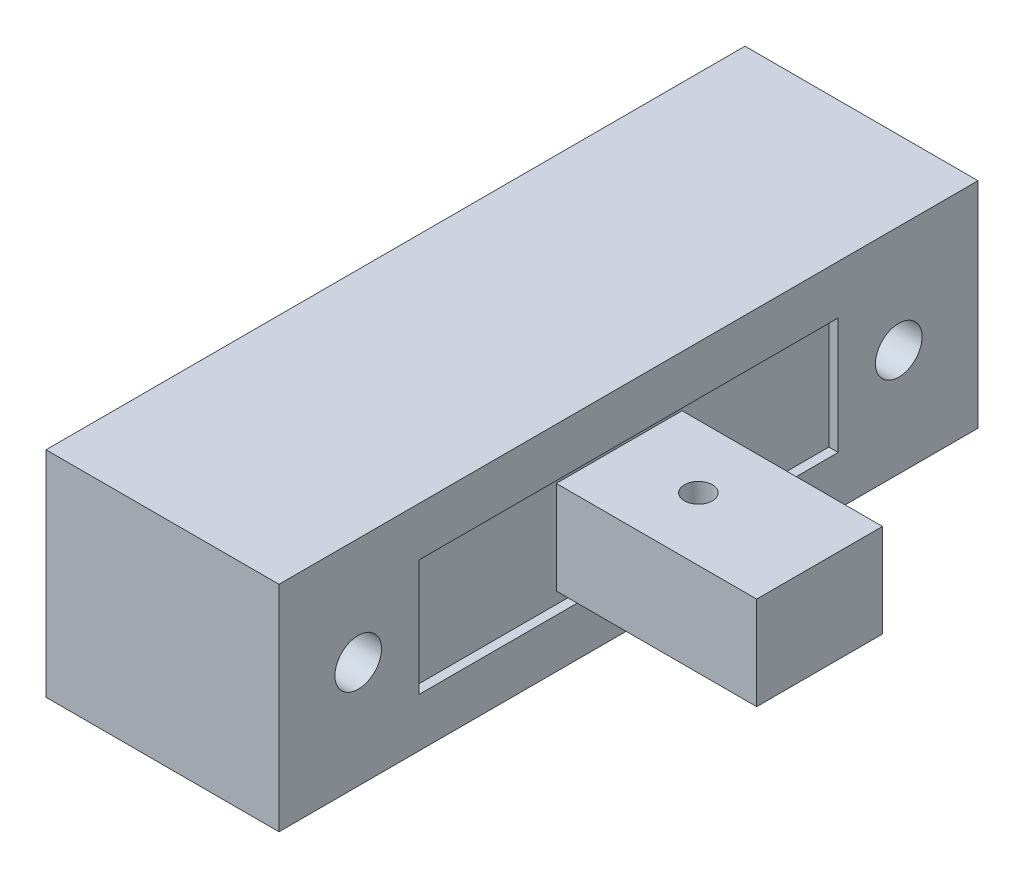
ISO-10303-21;
HEADER;
FILE_DESCRIPTION(('STEP AP214'),'2;1');
FILE_NAME('part.step','',(''),(''),'','','');
FILE_SCHEMA(('AUTOMOTIVE_DESIGN { 1 0 10303 214 1 1 1 1 }'));
ENDSEC;
DATA;
#1=APPLICATION_CONTEXT('core data for automotive mechanical design processes');
#2=APPLICATION_PROTOCOL_DEFINITION('international standard','automotive_design',2000,#1);
#3=PRODUCT_CONTEXT('',#1,'mechanical');
#4=PRODUCT('Part','Part','',(#3));
#5=PRODUCT_RELATED_PRODUCT_CATEGORY('part','',(#4));
#6=PRODUCT_DEFINITION_FORMATION('','',#4);
#7=PRODUCT_DEFINITION_CONTEXT('part definition',#1,'design');
#8=PRODUCT_DEFINITION('design','',#6,#7);
#9=PRODUCT_DEFINITION_SHAPE('','',#8);
#10=(LENGTH_UNIT() NAMED_UNIT(*) SI_UNIT(.MILLI.,.METRE.));
#11=(NAMED_UNIT(*) PLANE_ANGLE_UNIT() SI_UNIT($,.RADIAN.));
#12=(NAMED_UNIT(*) SI_UNIT($,.STERADIAN.) SOLID_ANGLE_UNIT());
#13=UNCERTAINTY_MEASURE_WITH_UNIT(LENGTH_MEASURE(1.E-05),#10,'distance_accuracy_value','');
#14=(GEOMETRIC_REPRESENTATION_CONTEXT(3) GLOBAL_UNCERTAINTY_ASSIGNED_CONTEXT((#13)) GLOBAL_UNIT_ASSIGNED_CONTEXT((#10,
#11,#12)) REPRESENTATION_CONTEXT('',''));
#15=CARTESIAN_POINT('',(0.,0.,0.));
#16=DIRECTION('',(0.,0.,1.));
#17=DIRECTION('',(1.,0.,0.));
#18=AXIS2_PLACEMENT_3D('',#15,#16,#17);
#19=CARTESIAN_POINT('',(4.6,0.,0.));
#20=DIRECTION('',(-1.,0.,0.));
#21=DIRECTION('',(0.,0.,1.));
#22=AXIS2_PLACEMENT_3D('',#19,#20,#21);
#23=PLANE('',#22);
#24=DIRECTION('',(0.,1.,0.));
#25=VECTOR('',#24,1.);
#26=CARTESIAN_POINT('',(4.6,-2.5,-9.));
#27=LINE('',#26,#25);
#28=CARTESIAN_POINT('',(4.6,-2.5,-9.));
#29=VERTEX_POINT('',#28);
#30=CARTESIAN_POINT('',(4.6,2.5,-9.));
#31=VERTEX_POINT('',#30);
#32=EDGE_CURVE('E155',#29,#31,#27,.T.);
#33=ORIENTED_EDGE('',*,*,#32,.T.);
#34=DIRECTION('',(0.,0.,1.));
#35=VECTOR('',#34,1.);
#36=CARTESIAN_POINT('',(4.6,2.5,9.));
#37=LINE('',#36,#35);
#38=CARTESIAN_POINT('',(4.6,2.5,9.));
#39=VERTEX_POINT('',#38);
#40=EDGE_CURVE('E158',#31,#39,#37,.T.);
#41=ORIENTED_EDGE('',*,*,#40,.T.);
#42=DIRECTION('',(0.,-1.,0.));
#43=VECTOR('',#42,1.);
#44=CARTESIAN_POINT('',(4.6,-2.5,9.));
#45=LINE('',#44,#43);
#46=CARTESIAN_POINT('',(4.6,-2.5,9.));
#47=VERTEX_POINT('',#46);
#48=EDGE_CURVE('E162',#39,#47,#45,.T.);
#49=ORIENTED_EDGE('',*,*,#48,.T.);
#50=DIRECTION('',(0.,0.,-1.));
#51=VECTOR('',#50,1.);
#52=CARTESIAN_POINT('',(4.6,-2.5,9.));
#53=LINE('',#52,#51);
#54=EDGE_CURVE('E165',#47,#29,#53,.T.);
#55=ORIENTED_EDGE('',*,*,#54,.T.);
#56=EDGE_LOOP('',(#33,#41,#49,#55));
#57=FACE_BOUND('',#56,.T.);
#58=DIRECTION('',(0.,1.,0.));
#59=VECTOR('',#58,1.);
#60=CARTESIAN_POINT('',(4.6,-2.,-2.7));
#61=LINE('',#60,#59);
#62=CARTESIAN_POINT('',(4.6,-2.,-2.7));
#63=VERTEX_POINT('',#62);
#64=CARTESIAN_POINT('',(4.6,2.,-2.7));
#65=VERTEX_POINT('',#64);
#66=EDGE_CURVE('E146',#63,#65,#61,.T.);
#67=ORIENTED_EDGE('',*,*,#66,.F.);
#68=DIRECTION('',(0.,0.,-1.));
#69=VECTOR('',#68,1.);
#70=CARTESIAN_POINT('',(4.6,-2.,2.7));
#71=LINE('',#70,#69);
#72=CARTESIAN_POINT('',(4.6,-2.,2.7));
#73=VERTEX_POINT('',#72);
#74=EDGE_CURVE('E143',#73,#63,#71,.T.);
#75=ORIENTED_EDGE('',*,*,#74,.F.);
#76=DIRECTION('',(0.,-1.,0.));
#77=VECTOR('',#76,1.);
#78=CARTESIAN_POINT('',(4.6,-2.,2.7));
#79=LINE('',#78,#77);
#80=CARTESIAN_POINT('',(4.6,2.,2.7));
#81=VERTEX_POINT('',#80);
#82=EDGE_CURVE('E57',#81,#73,#79,.T.);
#83=ORIENTED_EDGE('',*,*,#82,.F.);
#84=DIRECTION('',(0.,0.,1.));
#85=VECTOR('',#84,1.);
#86=CARTESIAN_POINT('',(4.6,2.,2.7));
#87=LINE('',#86,#85);
#88=EDGE_CURVE('E52',#65,#81,#87,.T.);
#89=ORIENTED_EDGE('',*,*,#88,.F.);
#90=EDGE_LOOP('',(#67,#75,#83,#89));
#91=FACE_BOUND('',#90,.T.);
#92=ADVANCED_FACE('F37',(#57,#91),#23,.F.);
#93=CARTESIAN_POINT('',(5.,4.6,15.));
#94=DIRECTION('',(-1.,0.,0.));
#95=DIRECTION('',(0.,0.,1.));
#96=AXIS2_PLACEMENT_3D('',#93,#94,#95);
#97=PLANE('',#96);
#98=CARTESIAN_POINT('',(5.,0.,11.6));
#99=DIRECTION('',(1.,0.,0.));
#100=DIRECTION('',(0.,0.,-1.));
#101=AXIS2_PLACEMENT_3D('',#98,#99,#100);
#102=CIRCLE('',#101,1.);
#103=CARTESIAN_POINT('',(5.,0.,10.6));
#104=VERTEX_POINT('',#103);
#105=EDGE_CURVE('E409',#104,#104,#102,.T.);
#106=ORIENTED_EDGE('',*,*,#105,.F.);
#107=EDGE_LOOP('',(#106));
#108=FACE_BOUND('',#107,.T.);
#109=CARTESIAN_POINT('',(5.,0.,-11.6));
#110=DIRECTION('',(1.,0.,0.));
#111=DIRECTION('',(0.,0.,-1.));
#112=AXIS2_PLACEMENT_3D('',#109,#110,#111);
#113=CIRCLE('',#112,1.);
#114=CARTESIAN_POINT('',(5.,0.,-12.6));
#115=VERTEX_POINT('',#114);
#116=EDGE_CURVE('E411',#115,#115,#113,.T.);
#117=ORIENTED_EDGE('',*,*,#116,.F.);
#118=EDGE_LOOP('',(#117));
#119=FACE_BOUND('',#118,.T.);
#120=DIRECTION('',(0.,0.,1.));
#121=VECTOR('',#120,1.);
#122=CARTESIAN_POINT('',(5.,2.5,9.));
#123=LINE('',#122,#121);
#124=CARTESIAN_POINT('',(5.,2.5,-9.));
#125=VERTEX_POINT('',#124);
#126=CARTESIAN_POINT('',(5.,2.5,9.));
#127=VERTEX_POINT('',#126);
#128=EDGE_CURVE('E149',#125,#127,#123,.T.);
#129=ORIENTED_EDGE('',*,*,#128,.F.);
#130=DIRECTION('',(0.,1.,0.));
#131=VECTOR('',#130,1.);
#132=CARTESIAN_POINT('',(5.,-2.5,-9.));
#133=LINE('',#132,#131);
#134=CARTESIAN_POINT('',(5.,-2.5,-9.));
#135=VERTEX_POINT('',#134);
#136=EDGE_CURVE('E147',#135,#125,#133,.T.);
#137=ORIENTED_EDGE('',*,*,#136,.F.);
#138=DIRECTION('',(0.,0.,-1.));
#139=VECTOR('',#138,1.);
#140=CARTESIAN_POINT('',(5.,-2.5,9.));
#141=LINE('',#140,#139);
#142=CARTESIAN_POINT('',(5.,-2.5,9.));
#143=VERTEX_POINT('',#142);
#144=EDGE_CURVE('E159',#143,#135,#141,.T.);
#145=ORIENTED_EDGE('',*,*,#144,.F.);
#146=DIRECTION('',(0.,-1.,0.));
#147=VECTOR('',#146,1.);
#148=CARTESIAN_POINT('',(5.,-2.5,9.));
#149=LINE('',#148,#147);
#150=EDGE_CURVE('E171',#127,#143,#149,.T.);
#151=ORIENTED_EDGE('',*,*,#150,.F.);
#152=EDGE_LOOP('',(#129,#137,#145,#151));
#153=FACE_BOUND('',#152,.T.);
#154=DIRECTION('',(0.,0.,-1.));
#155=VECTOR('',#154,1.);
#156=CARTESIAN_POINT('',(5.,-4.6,15.));
#157=LINE('',#156,#155);
#158=CARTESIAN_POINT('',(5.,-4.6,15.));
#159=VERTEX_POINT('',#158);
#160=CARTESIAN_POINT('',(5.,-4.6,-15.));
#161=VERTEX_POINT('',#160);
#162=EDGE_CURVE('E178',#159,#161,#157,.T.);
#163=ORIENTED_EDGE('',*,*,#162,.T.);
#164=DIRECTION('',(0.,-1.,0.));
#165=VECTOR('',#164,1.);
#166=CARTESIAN_POINT('',(5.,4.6,-15.));
#167=LINE('',#166,#165);
#168=CARTESIAN_POINT('',(5.,4.6,-15.));
#169=VERTEX_POINT('',#168);
#170=EDGE_CURVE('E11',#169,#161,#167,.T.);
#171=ORIENTED_EDGE('',*,*,#170,.F.);
#172=DIRECTION('',(0.,0.,-1.));
#173=VECTOR('',#172,1.);
#174=CARTESIAN_POINT('',(5.,4.6,15.));
#175=LINE('',#174,#173);
#176=CARTESIAN_POINT('',(5.,4.6,15.));
#177=VERTEX_POINT('',#176);
#178=EDGE_CURVE('E185',#177,#169,#175,.T.);
#179=ORIENTED_EDGE('',*,*,#178,.F.);
#180=DIRECTION('',(0.,-1.,0.));
#181=VECTOR('',#180,1.);
#182=CARTESIAN_POINT('',(5.,4.6,15.));
#183=LINE('',#182,#181);
#184=EDGE_CURVE('E195',#177,#159,#183,.T.);
#185=ORIENTED_EDGE('',*,*,#184,.T.);
#186=EDGE_LOOP('',(#163,#171,#179,#185));
#187=FACE_BOUND('',#186,.T.);
#188=ADVANCED_FACE('F39',(#108,#119,#153,#187),#97,.F.);
#189=CARTESIAN_POINT('',(-5.,4.6,-15.));
#190=DIRECTION('',(0.,0.,1.));
#191=DIRECTION('',(1.,0.,0.));
#192=AXIS2_PLACEMENT_3D('',#189,#190,#191);
#193=PLANE('',#192);
#194=DIRECTION('',(-1.,0.,0.));
#195=VECTOR('',#194,1.);
#196=CARTESIAN_POINT('',(-5.,-4.6,-15.));
#197=LINE('',#196,#195);
#198=CARTESIAN_POINT('',(-5.,-4.6,-15.));
#199=VERTEX_POINT('',#198);
#200=EDGE_CURVE('E198',#161,#199,#197,.T.);
#201=ORIENTED_EDGE('',*,*,#200,.T.);
#202=DIRECTION('',(0.,-1.,0.));
#203=VECTOR('',#202,1.);
#204=CARTESIAN_POINT('',(-5.,4.6,-15.));
#205=LINE('',#204,#203);
#206=CARTESIAN_POINT('',(-5.,4.6,-15.));
#207=VERTEX_POINT('',#206);
#208=EDGE_CURVE('E45',#207,#199,#205,.T.);
#209=ORIENTED_EDGE('',*,*,#208,.F.);
#210=DIRECTION('',(-1.,0.,0.));
#211=VECTOR('',#210,1.);
#212=CARTESIAN_POINT('',(-5.,4.6,-15.));
#213=LINE('',#212,#211);
#214=EDGE_CURVE('E188',#169,#207,#213,.T.);
#215=ORIENTED_EDGE('',*,*,#214,.F.);
#216=ORIENTED_EDGE('',*,*,#170,.T.);
#217=EDGE_LOOP('',(#201,#209,#215,#216));
#218=FACE_BOUND('',#217,.T.);
#219=ADVANCED_FACE('F228',(#218),#193,.F.);
#220=CARTESIAN_POINT('',(-5.,4.6,15.));
#221=DIRECTION('',(1.,0.,0.));
#222=DIRECTION('',(0.,0.,-1.));
#223=AXIS2_PLACEMENT_3D('',#220,#221,#222);
#224=PLANE('',#223);
#225=CARTESIAN_POINT('',(-5.,0.,11.6));
#226=DIRECTION('',(1.,0.,0.));
#227=DIRECTION('',(0.,0.,-1.));
#228=AXIS2_PLACEMENT_3D('',#225,#226,#227);
#229=CIRCLE('',#228,1.);
#230=CARTESIAN_POINT('',(-5.,0.,10.6));
#231=VERTEX_POINT('',#230);
#232=EDGE_CURVE('E406',#231,#231,#229,.T.);
#233=ORIENTED_EDGE('',*,*,#232,.T.);
#234=EDGE_LOOP('',(#233));
#235=FACE_BOUND('',#234,.T.);
#236=CARTESIAN_POINT('',(-5.,0.,-11.6));
#237=DIRECTION('',(1.,0.,0.));
#238=DIRECTION('',(0.,0.,-1.));
#239=AXIS2_PLACEMENT_3D('',#236,#237,#238);
#240=CIRCLE('',#239,1.);
#241=CARTESIAN_POINT('',(-5.,0.,-12.6));
#242=VERTEX_POINT('',#241);
#243=EDGE_CURVE('E414',#242,#242,#240,.T.);
#244=ORIENTED_EDGE('',*,*,#243,.T.);
#245=EDGE_LOOP('',(#244));
#246=FACE_BOUND('',#245,.T.);
#247=DIRECTION('',(0.,0.,1.));
#248=VECTOR('',#247,1.);
#249=CARTESIAN_POINT('',(-5.,-4.6,15.));
#250=LINE('',#249,#248);
#251=CARTESIAN_POINT('',(-5.,-4.6,15.));
#252=VERTEX_POINT('',#251);
#253=EDGE_CURVE('E200',#199,#252,#250,.T.);
#254=ORIENTED_EDGE('',*,*,#253,.T.);
#255=DIRECTION('',(0.,-1.,0.));
#256=VECTOR('',#255,1.);
#257=CARTESIAN_POINT('',(-5.,4.6,15.));
#258=LINE('',#257,#256);
#259=CARTESIAN_POINT('',(-5.,4.6,15.));
#260=VERTEX_POINT('',#259);
#261=EDGE_CURVE('E205',#260,#252,#258,.T.);
#262=ORIENTED_EDGE('',*,*,#261,.F.);
#263=DIRECTION('',(0.,0.,1.));
#264=VECTOR('',#263,1.);
#265=CARTESIAN_POINT('',(-5.,4.6,15.));
#266=LINE('',#265,#264);
#267=EDGE_CURVE('E191',#207,#260,#266,.T.);
#268=ORIENTED_EDGE('',*,*,#267,.F.);
#269=ORIENTED_EDGE('',*,*,#208,.T.);
#270=EDGE_LOOP('',(#254,#262,#268,#269));
#271=FACE_BOUND('',#270,.T.);
#272=ADVANCED_FACE('F212',(#235,#246,#271),#224,.F.);
#273=CARTESIAN_POINT('',(-5.,4.6,15.));
#274=DIRECTION('',(0.,0.,-1.));
#275=DIRECTION('',(-1.,0.,0.));
#276=AXIS2_PLACEMENT_3D('',#273,#274,#275);
#277=PLANE('',#276);
#278=DIRECTION('',(1.,0.,0.));
#279=VECTOR('',#278,1.);
#280=CARTESIAN_POINT('',(-5.,-4.6,15.));
#281=LINE('',#280,#279);
#282=EDGE_CURVE('E189',#252,#159,#281,.T.);
#283=ORIENTED_EDGE('',*,*,#282,.T.);
#284=ORIENTED_EDGE('',*,*,#184,.F.);
#285=DIRECTION('',(1.,0.,0.));
#286=VECTOR('',#285,1.);
#287=CARTESIAN_POINT('',(-5.,4.6,15.));
#288=LINE('',#287,#286);
#289=EDGE_CURVE('E193',#260,#177,#288,.T.);
#290=ORIENTED_EDGE('',*,*,#289,.F.);
#291=ORIENTED_EDGE('',*,*,#261,.T.);
#292=EDGE_LOOP('',(#283,#284,#290,#291));
#293=FACE_BOUND('',#292,.T.);
#294=ADVANCED_FACE('F221',(#293),#277,.F.);
#295=CARTESIAN_POINT('',(0.,4.6,0.));
#296=DIRECTION('',(0.,-1.,0.));
#297=DIRECTION('',(0.,0.,-1.));
#298=AXIS2_PLACEMENT_3D('',#295,#296,#297);
#299=PLANE('',#298);
#300=ORIENTED_EDGE('',*,*,#178,.T.);
#301=ORIENTED_EDGE('',*,*,#214,.T.);
#302=ORIENTED_EDGE('',*,*,#267,.T.);
#303=ORIENTED_EDGE('',*,*,#289,.T.);
#304=EDGE_LOOP('',(#300,#301,#302,#303));
#305=FACE_BOUND('',#304,.T.);
#306=ADVANCED_FACE('F227',(#305),#299,.F.);
#307=CARTESIAN_POINT('',(0.,-4.6,0.));
#308=DIRECTION('',(0.,-1.,0.));
#309=DIRECTION('',(0.,0.,-1.));
#310=AXIS2_PLACEMENT_3D('',#307,#308,#309);
#311=PLANE('',#310);
#312=ORIENTED_EDGE('',*,*,#162,.F.);
#313=ORIENTED_EDGE('',*,*,#282,.F.);
#314=ORIENTED_EDGE('',*,*,#253,.F.);
#315=ORIENTED_EDGE('',*,*,#200,.F.);
#316=EDGE_LOOP('',(#312,#313,#314,#315));
#317=FACE_BOUND('',#316,.T.);
#318=ADVANCED_FACE('F218',(#317),#311,.T.);
#319=CARTESIAN_POINT('',(4.6,-2.5,-9.));
#320=DIRECTION('',(0.,0.,-1.));
#321=DIRECTION('',(-1.,0.,0.));
#322=AXIS2_PLACEMENT_3D('',#319,#320,#321);
#323=PLANE('',#322);
#324=ORIENTED_EDGE('',*,*,#136,.T.);
#325=DIRECTION('',(1.,0.,0.));
#326=VECTOR('',#325,1.);
#327=CARTESIAN_POINT('',(4.6,2.5,-9.));
#328=LINE('',#327,#326);
#329=EDGE_CURVE('E167',#31,#125,#328,.T.);
#330=ORIENTED_EDGE('',*,*,#329,.F.);
#331=ORIENTED_EDGE('',*,*,#32,.F.);
#332=DIRECTION('',(1.,0.,0.));
#333=VECTOR('',#332,1.);
#334=CARTESIAN_POINT('',(4.6,-2.5,-9.));
#335=LINE('',#334,#333);
#336=EDGE_CURVE('E176',#29,#135,#335,.T.);
#337=ORIENTED_EDGE('',*,*,#336,.T.);
#338=EDGE_LOOP('',(#324,#330,#331,#337));
#339=FACE_BOUND('',#338,.T.);
#340=ADVANCED_FACE('F249',(#339),#323,.F.);
#341=CARTESIAN_POINT('',(4.6,-2.5,9.));
#342=DIRECTION('',(0.,-1.,0.));
#343=DIRECTION('',(0.,0.,-1.));
#344=AXIS2_PLACEMENT_3D('',#341,#342,#343);
#345=PLANE('',#344);
#346=ORIENTED_EDGE('',*,*,#144,.T.);
#347=ORIENTED_EDGE('',*,*,#336,.F.);
#348=ORIENTED_EDGE('',*,*,#54,.F.);
#349=DIRECTION('',(1.,0.,0.));
#350=VECTOR('',#349,1.);
#351=CARTESIAN_POINT('',(4.6,-2.5,9.));
#352=LINE('',#351,#350);
#353=EDGE_CURVE('E179',#47,#143,#352,.T.);
#354=ORIENTED_EDGE('',*,*,#353,.T.);
#355=EDGE_LOOP('',(#346,#347,#348,#354));
#356=FACE_BOUND('',#355,.T.);
#357=ADVANCED_FACE('F245',(#356),#345,.F.);
#358=CARTESIAN_POINT('',(4.6,-2.5,9.));
#359=DIRECTION('',(0.,0.,1.));
#360=DIRECTION('',(1.,0.,0.));
#361=AXIS2_PLACEMENT_3D('',#358,#359,#360);
#362=PLANE('',#361);
#363=ORIENTED_EDGE('',*,*,#150,.T.);
#364=ORIENTED_EDGE('',*,*,#353,.F.);
#365=ORIENTED_EDGE('',*,*,#48,.F.);
#366=DIRECTION('',(1.,0.,0.));
#367=VECTOR('',#366,1.);
#368=CARTESIAN_POINT('',(4.6,2.5,9.));
#369=LINE('',#368,#367);
#370=EDGE_CURVE('E181',#39,#127,#369,.T.);
#371=ORIENTED_EDGE('',*,*,#370,.T.);
#372=EDGE_LOOP('',(#363,#364,#365,#371));
#373=FACE_BOUND('',#372,.T.);
#374=ADVANCED_FACE('F248',(#373),#362,.F.);
#375=CARTESIAN_POINT('',(4.6,2.5,9.));
#376=DIRECTION('',(0.,1.,0.));
#377=DIRECTION('',(0.,0.,1.));
#378=AXIS2_PLACEMENT_3D('',#375,#376,#377);
#379=PLANE('',#378);
#380=ORIENTED_EDGE('',*,*,#128,.T.);
#381=ORIENTED_EDGE('',*,*,#370,.F.);
#382=ORIENTED_EDGE('',*,*,#40,.F.);
#383=ORIENTED_EDGE('',*,*,#329,.T.);
#384=EDGE_LOOP('',(#380,#381,#382,#383));
#385=FACE_BOUND('',#384,.T.);
#386=ADVANCED_FACE('F253',(#385),#379,.F.);
#387=CARTESIAN_POINT('',(13.2,-2.,-2.7));
#388=DIRECTION('',(0.,0.,1.));
#389=DIRECTION('',(1.,0.,0.));
#390=AXIS2_PLACEMENT_3D('',#387,#388,#389);
#391=PLANE('',#390);
#392=ORIENTED_EDGE('',*,*,#66,.T.);
#393=DIRECTION('',(-1.,0.,0.));
#394=VECTOR('',#393,1.);
#395=CARTESIAN_POINT('',(13.2,2.,-2.7));
#396=LINE('',#395,#394);
#397=CARTESIAN_POINT('',(13.2,2.,-2.7));
#398=VERTEX_POINT('',#397);
#399=EDGE_CURVE('E127',#398,#65,#396,.T.);
#400=ORIENTED_EDGE('',*,*,#399,.F.);
#401=DIRECTION('',(0.,1.,0.));
#402=VECTOR('',#401,1.);
#403=CARTESIAN_POINT('',(13.2,-2.,-2.7));
#404=LINE('',#403,#402);
#405=CARTESIAN_POINT('',(13.2,-2.,-2.7));
#406=VERTEX_POINT('',#405);
#407=EDGE_CURVE('E134',#406,#398,#404,.T.);
#408=ORIENTED_EDGE('',*,*,#407,.F.);
#409=DIRECTION('',(-1.,0.,0.));
#410=VECTOR('',#409,1.);
#411=CARTESIAN_POINT('',(13.2,-2.,-2.7));
#412=LINE('',#411,#410);
#413=EDGE_CURVE('E427',#406,#63,#412,.T.);
#414=ORIENTED_EDGE('',*,*,#413,.T.);
#415=EDGE_LOOP('',(#392,#400,#408,#414));
#416=FACE_BOUND('',#415,.T.);
#417=ADVANCED_FACE('F145',(#416),#391,.F.);
#418=CARTESIAN_POINT('',(13.2,2.,2.7));
#419=DIRECTION('',(0.,-1.,0.));
#420=DIRECTION('',(0.,0.,-1.));
#421=AXIS2_PLACEMENT_3D('',#418,#419,#420);
#422=PLANE('',#421);
#423=CARTESIAN_POINT('',(8.,2.,0.));
#424=DIRECTION('',(0.,1.,0.));
#425=DIRECTION('',(0.,0.,1.));
#426=AXIS2_PLACEMENT_3D('',#423,#424,#425);
#427=CIRCLE('',#426,0.6);
#428=CARTESIAN_POINT('',(8.,2.,0.6));
#429=VERTEX_POINT('',#428);
#430=EDGE_CURVE('E417',#429,#429,#427,.T.);
#431=ORIENTED_EDGE('',*,*,#430,.F.);
#432=EDGE_LOOP('',(#431));
#433=FACE_BOUND('',#432,.T.);
#434=ORIENTED_EDGE('',*,*,#88,.T.);
#435=DIRECTION('',(-1.,0.,0.));
#436=VECTOR('',#435,1.);
#437=CARTESIAN_POINT('',(13.2,2.,2.7));
#438=LINE('',#437,#436);
#439=CARTESIAN_POINT('',(13.2,2.,2.7));
#440=VERTEX_POINT('',#439);
#441=EDGE_CURVE('E130',#440,#81,#438,.T.);
#442=ORIENTED_EDGE('',*,*,#441,.F.);
#443=DIRECTION('',(0.,0.,1.));
#444=VECTOR('',#443,1.);
#445=CARTESIAN_POINT('',(13.2,2.,2.7));
#446=LINE('',#445,#444);
#447=EDGE_CURVE('E123',#398,#440,#446,.T.);
#448=ORIENTED_EDGE('',*,*,#447,.F.);
#449=ORIENTED_EDGE('',*,*,#399,.T.);
#450=EDGE_LOOP('',(#434,#442,#448,#449));
#451=FACE_BOUND('',#450,.T.);
#452=ADVANCED_FACE('F125',(#433,#451),#422,.F.);
#453=CARTESIAN_POINT('',(13.2,-2.,2.7));
#454=DIRECTION('',(0.,0.,-1.));
#455=DIRECTION('',(-1.,0.,0.));
#456=AXIS2_PLACEMENT_3D('',#453,#454,#455);
#457=PLANE('',#456);
#458=ORIENTED_EDGE('',*,*,#82,.T.);
#459=DIRECTION('',(-1.,0.,0.));
#460=VECTOR('',#459,1.);
#461=CARTESIAN_POINT('',(13.2,-2.,2.7));
#462=LINE('',#461,#460);
#463=CARTESIAN_POINT('',(13.2,-2.,2.7));
#464=VERTEX_POINT('',#463);
#465=EDGE_CURVE('E151',#464,#73,#462,.T.);
#466=ORIENTED_EDGE('',*,*,#465,.F.);
#467=DIRECTION('',(0.,-1.,0.));
#468=VECTOR('',#467,1.);
#469=CARTESIAN_POINT('',(13.2,-2.,2.7));
#470=LINE('',#469,#468);
#471=EDGE_CURVE('E133',#440,#464,#470,.T.);
#472=ORIENTED_EDGE('',*,*,#471,.F.);
#473=ORIENTED_EDGE('',*,*,#441,.T.);
#474=EDGE_LOOP('',(#458,#466,#472,#473));
#475=FACE_BOUND('',#474,.T.);
#476=ADVANCED_FACE('F307',(#475),#457,.F.);
#477=CARTESIAN_POINT('',(13.2,-2.,2.7));
#478=DIRECTION('',(0.,1.,0.));
#479=DIRECTION('',(0.,0.,1.));
#480=AXIS2_PLACEMENT_3D('',#477,#478,#479);
#481=PLANE('',#480);
#482=CARTESIAN_POINT('',(8.,-2.,0.));
#483=DIRECTION('',(0.,1.,0.));
#484=DIRECTION('',(0.,0.,1.));
#485=AXIS2_PLACEMENT_3D('',#482,#483,#484);
#486=CIRCLE('',#485,0.6);
#487=CARTESIAN_POINT('',(8.,-2.,0.6));
#488=VERTEX_POINT('',#487);
#489=EDGE_CURVE('E420',#488,#488,#486,.T.);
#490=ORIENTED_EDGE('',*,*,#489,.T.);
#491=EDGE_LOOP('',(#490));
#492=FACE_BOUND('',#491,.T.);
#493=ORIENTED_EDGE('',*,*,#74,.T.);
#494=ORIENTED_EDGE('',*,*,#413,.F.);
#495=DIRECTION('',(0.,0.,-1.));
#496=VECTOR('',#495,1.);
#497=CARTESIAN_POINT('',(13.2,-2.,2.7));
#498=LINE('',#497,#496);
#499=EDGE_CURVE('E139',#464,#406,#498,.T.);
#500=ORIENTED_EDGE('',*,*,#499,.F.);
#501=ORIENTED_EDGE('',*,*,#465,.T.);
#502=EDGE_LOOP('',(#493,#494,#500,#501));
#503=FACE_BOUND('',#502,.T.);
#504=ADVANCED_FACE('F315',(#492,#503),#481,.F.);
#505=CARTESIAN_POINT('',(13.2,0.,0.));
#506=DIRECTION('',(-1.,0.,0.));
#507=DIRECTION('',(0.,0.,1.));
#508=AXIS2_PLACEMENT_3D('',#505,#506,#507);
#509=PLANE('',#508);
#510=ORIENTED_EDGE('',*,*,#407,.T.);
#511=ORIENTED_EDGE('',*,*,#447,.T.);
#512=ORIENTED_EDGE('',*,*,#471,.T.);
#513=ORIENTED_EDGE('',*,*,#499,.T.);
#514=EDGE_LOOP('',(#510,#511,#512,#513));
#515=FACE_BOUND('',#514,.T.);
#516=ADVANCED_FACE('F137',(#515),#509,.F.);
#517=CARTESIAN_POINT('',(8.,-2.,0.));
#518=DIRECTION('',(0.,1.,0.));
#519=DIRECTION('',(0.,0.,1.));
#520=AXIS2_PLACEMENT_3D('',#517,#518,#519);
#521=CYLINDRICAL_SURFACE('',#520,0.6);
#522=ORIENTED_EDGE('',*,*,#489,.F.);
#523=EDGE_LOOP('',(#522));
#524=FACE_BOUND('',#523,.T.);
#525=ORIENTED_EDGE('',*,*,#430,.T.);
#526=EDGE_LOOP('',(#525));
#527=FACE_BOUND('',#526,.T.);
#528=ADVANCED_FACE('F329',(#524,#527),#521,.F.);
#529=CARTESIAN_POINT('',(-5.,0.,-11.6));
#530=DIRECTION('',(1.,0.,0.));
#531=DIRECTION('',(0.,0.,-1.));
#532=AXIS2_PLACEMENT_3D('',#529,#530,#531);
#533=CYLINDRICAL_SURFACE('',#532,1.);
#534=ORIENTED_EDGE('',*,*,#243,.F.);
#535=EDGE_LOOP('',(#534));
#536=FACE_BOUND('',#535,.T.);
#537=ORIENTED_EDGE('',*,*,#116,.T.);
#538=EDGE_LOOP('',(#537));
#539=FACE_BOUND('',#538,.T.);
#540=ADVANCED_FACE('F335',(#536,#539),#533,.F.);
#541=CARTESIAN_POINT('',(-5.,0.,11.6));
#542=DIRECTION('',(1.,0.,0.));
#543=DIRECTION('',(0.,0.,-1.));
#544=AXIS2_PLACEMENT_3D('',#541,#542,#543);
#545=CYLINDRICAL_SURFACE('',#544,1.);
#546=ORIENTED_EDGE('',*,*,#232,.F.);
#547=EDGE_LOOP('',(#546));
#548=FACE_BOUND('',#547,.T.);
#549=ORIENTED_EDGE('',*,*,#105,.T.);
#550=EDGE_LOOP('',(#549));
#551=FACE_BOUND('',#550,.T.);
#552=ADVANCED_FACE('F344',(#548,#551),#545,.F.);
#553=CLOSED_SHELL('',(#92,#188,#219,#272,#294,#306,#318,#340,#357,#374,#386,#417,#452,#476,#504,
#516,#528,#540,#552));
#554=MANIFOLD_SOLID_BREP('B2',#553);
#555=ADVANCED_BREP_SHAPE_REPRESENTATION('',(#18,#554),#14);
#556=SHAPE_DEFINITION_REPRESENTATION(#9,#555);
ENDSEC;
END-ISO-10303-21;
